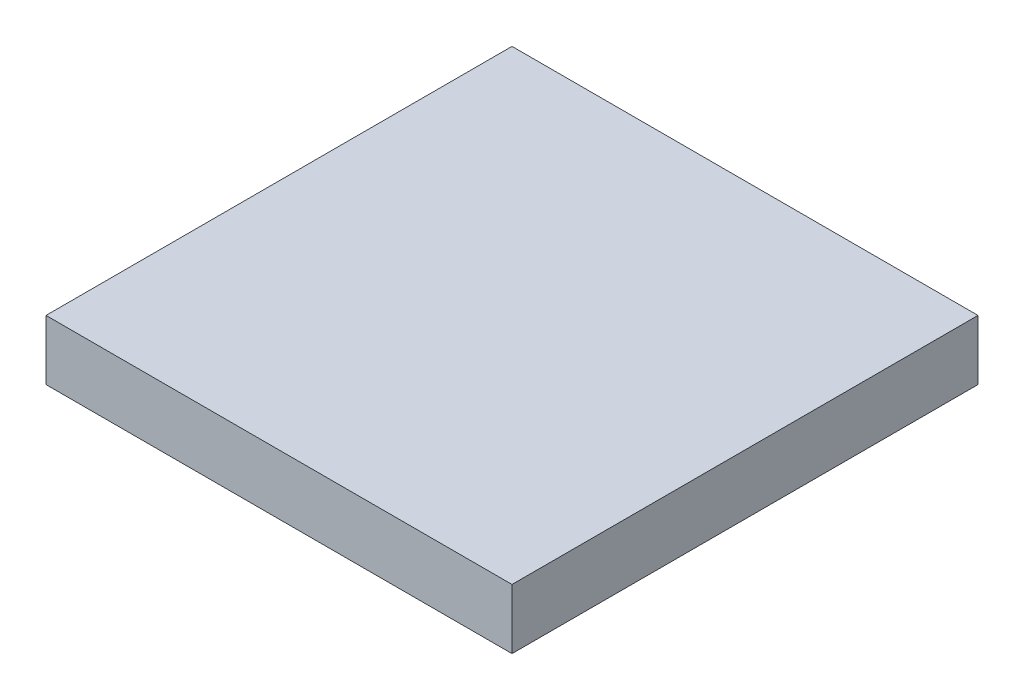
ISO-10303-21;
HEADER;
FILE_DESCRIPTION(('STEP AP214'),'2;1');
FILE_NAME('part.step','',(''),(''),'','','');
FILE_SCHEMA(('AUTOMOTIVE_DESIGN { 1 0 10303 214 1 1 1 1 }'));
ENDSEC;
DATA;
#1=APPLICATION_CONTEXT('core data for automotive mechanical design processes');
#2=APPLICATION_PROTOCOL_DEFINITION('international standard','automotive_design',2000,#1);
#3=PRODUCT_CONTEXT('',#1,'mechanical');
#4=PRODUCT('Part','Part','',(#3));
#5=PRODUCT_RELATED_PRODUCT_CATEGORY('part','',(#4));
#6=PRODUCT_DEFINITION_FORMATION('','',#4);
#7=PRODUCT_DEFINITION_CONTEXT('part definition',#1,'design');
#8=PRODUCT_DEFINITION('design','',#6,#7);
#9=PRODUCT_DEFINITION_SHAPE('','',#8);
#10=(LENGTH_UNIT() NAMED_UNIT(*) SI_UNIT(.MILLI.,.METRE.));
#11=(NAMED_UNIT(*) PLANE_ANGLE_UNIT() SI_UNIT($,.RADIAN.));
#12=(NAMED_UNIT(*) SI_UNIT($,.STERADIAN.) SOLID_ANGLE_UNIT());
#13=UNCERTAINTY_MEASURE_WITH_UNIT(LENGTH_MEASURE(1.E-05),#10,'distance_accuracy_value','');
#14=(GEOMETRIC_REPRESENTATION_CONTEXT(3) GLOBAL_UNCERTAINTY_ASSIGNED_CONTEXT((#13)) GLOBAL_UNIT_ASSIGNED_CONTEXT((#10,
#11,#12)) REPRESENTATION_CONTEXT('',''));
#15=CARTESIAN_POINT('',(0.,0.,0.));
#16=DIRECTION('',(0.,0.,1.));
#17=DIRECTION('',(1.,0.,0.));
#18=AXIS2_PLACEMENT_3D('',#15,#16,#17);
#19=CARTESIAN_POINT('',(3.5,0.9,-3.5));
#20=DIRECTION('',(-1.,0.,0.));
#21=DIRECTION('',(0.,0.,1.));
#22=AXIS2_PLACEMENT_3D('',#19,#20,#21);
#23=PLANE('',#22);
#24=DIRECTION('',(0.,0.,-1.));
#25=VECTOR('',#24,1.);
#26=CARTESIAN_POINT('',(3.5,0.,-3.5));
#27=LINE('',#26,#25);
#28=CARTESIAN_POINT('',(3.5,0.,3.5));
#29=VERTEX_POINT('',#28);
#30=CARTESIAN_POINT('',(3.5,0.,-3.5));
#31=VERTEX_POINT('',#30);
#32=EDGE_CURVE('E102',#29,#31,#27,.T.);
#33=ORIENTED_EDGE('',*,*,#32,.T.);
#34=DIRECTION('',(0.,-1.,0.));
#35=VECTOR('',#34,1.);
#36=CARTESIAN_POINT('',(3.5,0.9,-3.5));
#37=LINE('',#36,#35);
#38=CARTESIAN_POINT('',(3.5,0.9,-3.5));
#39=VERTEX_POINT('',#38);
#40=EDGE_CURVE('E11',#39,#31,#37,.T.);
#41=ORIENTED_EDGE('',*,*,#40,.F.);
#42=DIRECTION('',(0.,0.,-1.));
#43=VECTOR('',#42,1.);
#44=CARTESIAN_POINT('',(3.5,0.9,-3.5));
#45=LINE('',#44,#43);
#46=CARTESIAN_POINT('',(3.5,0.9,3.5));
#47=VERTEX_POINT('',#46);
#48=EDGE_CURVE('E90',#47,#39,#45,.T.);
#49=ORIENTED_EDGE('',*,*,#48,.F.);
#50=DIRECTION('',(0.,-1.,0.));
#51=VECTOR('',#50,1.);
#52=CARTESIAN_POINT('',(3.5,0.9,3.5));
#53=LINE('',#52,#51);
#54=EDGE_CURVE('E98',#47,#29,#53,.T.);
#55=ORIENTED_EDGE('',*,*,#54,.T.);
#56=EDGE_LOOP('',(#33,#41,#49,#55));
#57=FACE_BOUND('',#56,.T.);
#58=ADVANCED_FACE('F39',(#57),#23,.F.);
#59=CARTESIAN_POINT('',(-3.5,0.9,-3.5));
#60=DIRECTION('',(0.,0.,1.));
#61=DIRECTION('',(1.,0.,0.));
#62=AXIS2_PLACEMENT_3D('',#59,#60,#61);
#63=PLANE('',#62);
#64=DIRECTION('',(-1.,0.,0.));
#65=VECTOR('',#64,1.);
#66=CARTESIAN_POINT('',(-3.5,0.,-3.5));
#67=LINE('',#66,#65);
#68=CARTESIAN_POINT('',(-3.5,0.,-3.5));
#69=VERTEX_POINT('',#68);
#70=EDGE_CURVE('E94',#31,#69,#67,.T.);
#71=ORIENTED_EDGE('',*,*,#70,.T.);
#72=DIRECTION('',(0.,-1.,0.));
#73=VECTOR('',#72,1.);
#74=CARTESIAN_POINT('',(-3.5,0.9,-3.5));
#75=LINE('',#74,#73);
#76=CARTESIAN_POINT('',(-3.5,0.9,-3.5));
#77=VERTEX_POINT('',#76);
#78=EDGE_CURVE('E47',#77,#69,#75,.T.);
#79=ORIENTED_EDGE('',*,*,#78,.F.);
#80=DIRECTION('',(-1.,0.,0.));
#81=VECTOR('',#80,1.);
#82=CARTESIAN_POINT('',(-3.5,0.9,-3.5));
#83=LINE('',#82,#81);
#84=EDGE_CURVE('E85',#39,#77,#83,.T.);
#85=ORIENTED_EDGE('',*,*,#84,.F.);
#86=ORIENTED_EDGE('',*,*,#40,.T.);
#87=EDGE_LOOP('',(#71,#79,#85,#86));
#88=FACE_BOUND('',#87,.T.);
#89=ADVANCED_FACE('F93',(#88),#63,.F.);
#90=CARTESIAN_POINT('',(-3.5,0.9,-3.5));
#91=DIRECTION('',(1.,0.,0.));
#92=DIRECTION('',(0.,0.,-1.));
#93=AXIS2_PLACEMENT_3D('',#90,#91,#92);
#94=PLANE('',#93);
#95=DIRECTION('',(0.,0.,1.));
#96=VECTOR('',#95,1.);
#97=CARTESIAN_POINT('',(-3.5,0.,-3.5));
#98=LINE('',#97,#96);
#99=CARTESIAN_POINT('',(-3.5,0.,3.5));
#100=VERTEX_POINT('',#99);
#101=EDGE_CURVE('E72',#69,#100,#98,.T.);
#102=ORIENTED_EDGE('',*,*,#101,.T.);
#103=DIRECTION('',(0.,-1.,0.));
#104=VECTOR('',#103,1.);
#105=CARTESIAN_POINT('',(-3.5,0.9,3.5));
#106=LINE('',#105,#104);
#107=CARTESIAN_POINT('',(-3.5,0.9,3.5));
#108=VERTEX_POINT('',#107);
#109=EDGE_CURVE('E95',#108,#100,#106,.T.);
#110=ORIENTED_EDGE('',*,*,#109,.F.);
#111=DIRECTION('',(0.,0.,1.));
#112=VECTOR('',#111,1.);
#113=CARTESIAN_POINT('',(-3.5,0.9,-3.5));
#114=LINE('',#113,#112);
#115=EDGE_CURVE('E88',#77,#108,#114,.T.);
#116=ORIENTED_EDGE('',*,*,#115,.F.);
#117=ORIENTED_EDGE('',*,*,#78,.T.);
#118=EDGE_LOOP('',(#102,#110,#116,#117));
#119=FACE_BOUND('',#118,.T.);
#120=ADVANCED_FACE('F96',(#119),#94,.F.);
#121=CARTESIAN_POINT('',(-3.5,0.9,3.5));
#122=DIRECTION('',(0.,0.,-1.));
#123=DIRECTION('',(-1.,0.,0.));
#124=AXIS2_PLACEMENT_3D('',#121,#122,#123);
#125=PLANE('',#124);
#126=DIRECTION('',(1.,0.,0.));
#127=VECTOR('',#126,1.);
#128=CARTESIAN_POINT('',(-3.5,0.,3.5));
#129=LINE('',#128,#127);
#130=EDGE_CURVE('E78',#100,#29,#129,.T.);
#131=ORIENTED_EDGE('',*,*,#130,.T.);
#132=ORIENTED_EDGE('',*,*,#54,.F.);
#133=DIRECTION('',(1.,0.,0.));
#134=VECTOR('',#133,1.);
#135=CARTESIAN_POINT('',(-3.5,0.9,3.5));
#136=LINE('',#135,#134);
#137=EDGE_CURVE('E55',#108,#47,#136,.T.);
#138=ORIENTED_EDGE('',*,*,#137,.F.);
#139=ORIENTED_EDGE('',*,*,#109,.T.);
#140=EDGE_LOOP('',(#131,#132,#138,#139));
#141=FACE_BOUND('',#140,.T.);
#142=ADVANCED_FACE('F109',(#141),#125,.F.);
#143=CARTESIAN_POINT('',(0.,0.9,0.));
#144=DIRECTION('',(0.,1.,0.));
#145=DIRECTION('',(0.,0.,1.));
#146=AXIS2_PLACEMENT_3D('',#143,#144,#145);
#147=PLANE('',#146);
#148=ORIENTED_EDGE('',*,*,#48,.T.);
#149=ORIENTED_EDGE('',*,*,#84,.T.);
#150=ORIENTED_EDGE('',*,*,#115,.T.);
#151=ORIENTED_EDGE('',*,*,#137,.T.);
#152=EDGE_LOOP('',(#148,#149,#150,#151));
#153=FACE_BOUND('',#152,.T.);
#154=ADVANCED_FACE('F86',(#153),#147,.T.);
#155=CARTESIAN_POINT('',(0.,0.,0.));
#156=DIRECTION('',(0.,1.,0.));
#157=DIRECTION('',(0.,0.,1.));
#158=AXIS2_PLACEMENT_3D('',#155,#156,#157);
#159=PLANE('',#158);
#160=ORIENTED_EDGE('',*,*,#32,.F.);
#161=ORIENTED_EDGE('',*,*,#130,.F.);
#162=ORIENTED_EDGE('',*,*,#101,.F.);
#163=ORIENTED_EDGE('',*,*,#70,.F.);
#164=EDGE_LOOP('',(#160,#161,#162,#163));
#165=FACE_BOUND('',#164,.T.);
#166=ADVANCED_FACE('F112',(#165),#159,.F.);
#167=CLOSED_SHELL('',(#58,#89,#120,#142,#154,#166));
#168=MANIFOLD_SOLID_BREP('B2',#167);
#169=ADVANCED_BREP_SHAPE_REPRESENTATION('',(#18,#168),#14);
#170=SHAPE_DEFINITION_REPRESENTATION(#9,#169);
ENDSEC;
END-ISO-10303-21;
